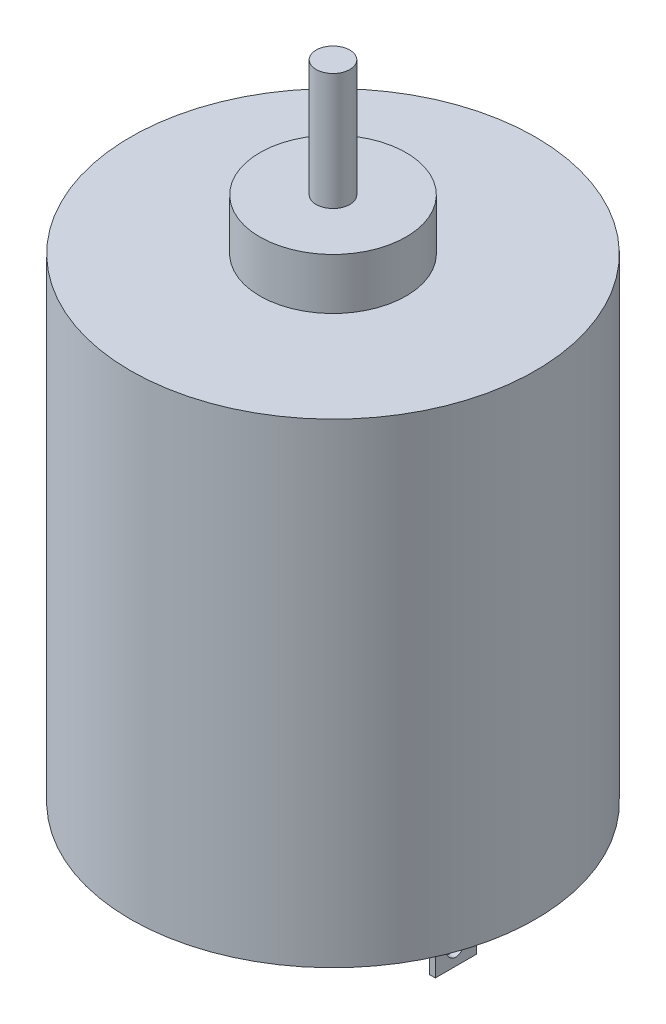
ISO-10303-21;
HEADER;
FILE_DESCRIPTION(('STEP AP214'),'2;1');
FILE_NAME('part.step','',(''),(''),'','','');
FILE_SCHEMA(('AUTOMOTIVE_DESIGN { 1 0 10303 214 1 1 1 1 }'));
ENDSEC;
DATA;
#1=APPLICATION_CONTEXT('core data for automotive mechanical design processes');
#2=APPLICATION_PROTOCOL_DEFINITION('international standard','automotive_design',2000,#1);
#3=PRODUCT_CONTEXT('',#1,'mechanical');
#4=PRODUCT('Part','Part','',(#3));
#5=PRODUCT_RELATED_PRODUCT_CATEGORY('part','',(#4));
#6=PRODUCT_DEFINITION_FORMATION('','',#4);
#7=PRODUCT_DEFINITION_CONTEXT('part definition',#1,'design');
#8=PRODUCT_DEFINITION('design','',#6,#7);
#9=PRODUCT_DEFINITION_SHAPE('','',#8);
#10=(LENGTH_UNIT() NAMED_UNIT(*) SI_UNIT(.MILLI.,.METRE.));
#11=(NAMED_UNIT(*) PLANE_ANGLE_UNIT() SI_UNIT($,.RADIAN.));
#12=(NAMED_UNIT(*) SI_UNIT($,.STERADIAN.) SOLID_ANGLE_UNIT());
#13=UNCERTAINTY_MEASURE_WITH_UNIT(LENGTH_MEASURE(1.E-05),#10,'distance_accuracy_value','');
#14=(GEOMETRIC_REPRESENTATION_CONTEXT(3) GLOBAL_UNCERTAINTY_ASSIGNED_CONTEXT((#13)) GLOBAL_UNIT_ASSIGNED_CONTEXT((#10,
#11,#12)) REPRESENTATION_CONTEXT('',''));
#15=CARTESIAN_POINT('',(0.,0.,0.));
#16=DIRECTION('',(0.,0.,1.));
#17=DIRECTION('',(1.,0.,0.));
#18=AXIS2_PLACEMENT_3D('',#15,#16,#17);
#19=CARTESIAN_POINT('',(0.,0.,0.));
#20=DIRECTION('',(0.,1.,0.));
#21=DIRECTION('',(0.,0.,1.));
#22=AXIS2_PLACEMENT_3D('',#19,#20,#21);
#23=PLANE('',#22);
#24=DIRECTION('',(1.,0.,0.));
#25=VECTOR('',#24,1.);
#26=CARTESIAN_POINT('',(8.,0.,-1.4));
#27=LINE('',#26,#25);
#28=CARTESIAN_POINT('',(8.,0.,-1.4));
#29=VERTEX_POINT('',#28);
#30=CARTESIAN_POINT('',(8.4,0.,-1.4));
#31=VERTEX_POINT('',#30);
#32=EDGE_CURVE('E121',#29,#31,#27,.T.);
#33=ORIENTED_EDGE('',*,*,#32,.F.);
#34=DIRECTION('',(0.,0.,1.));
#35=VECTOR('',#34,1.);
#36=CARTESIAN_POINT('',(8.,0.,-1.4));
#37=LINE('',#36,#35);
#38=CARTESIAN_POINT('',(8.,0.,1.4));
#39=VERTEX_POINT('',#38);
#40=EDGE_CURVE('E140',#29,#39,#37,.T.);
#41=ORIENTED_EDGE('',*,*,#40,.T.);
#42=DIRECTION('',(1.,0.,0.));
#43=VECTOR('',#42,1.);
#44=CARTESIAN_POINT('',(8.,0.,1.4));
#45=LINE('',#44,#43);
#46=CARTESIAN_POINT('',(8.4,0.,1.4));
#47=VERTEX_POINT('',#46);
#48=EDGE_CURVE('E57',#39,#47,#45,.T.);
#49=ORIENTED_EDGE('',*,*,#48,.T.);
#50=DIRECTION('',(0.,0.,1.));
#51=VECTOR('',#50,1.);
#52=CARTESIAN_POINT('',(8.4,0.,-1.4));
#53=LINE('',#52,#51);
#54=EDGE_CURVE('E124',#31,#47,#53,.T.);
#55=ORIENTED_EDGE('',*,*,#54,.F.);
#56=EDGE_LOOP('',(#33,#41,#49,#55));
#57=FACE_BOUND('',#56,.T.);
#58=CARTESIAN_POINT('',(0.,0.,0.));
#59=DIRECTION('',(0.,1.,0.));
#60=DIRECTION('',(0.,0.,1.));
#61=AXIS2_PLACEMENT_3D('',#58,#59,#60);
#62=CIRCLE('',#61,5.);
#63=CARTESIAN_POINT('',(0.,0.,5.));
#64=VERTEX_POINT('',#63);
#65=EDGE_CURVE('E176',#64,#64,#62,.T.);
#66=ORIENTED_EDGE('',*,*,#65,.T.);
#67=EDGE_LOOP('',(#66));
#68=FACE_BOUND('',#67,.T.);
#69=CARTESIAN_POINT('',(0.,0.,0.));
#70=DIRECTION('',(0.,1.,0.));
#71=DIRECTION('',(0.,0.,1.));
#72=AXIS2_PLACEMENT_3D('',#69,#70,#71);
#73=CIRCLE('',#72,13.85);
#74=CARTESIAN_POINT('',(0.,0.,13.85));
#75=VERTEX_POINT('',#74);
#76=EDGE_CURVE('E182',#75,#75,#73,.T.);
#77=ORIENTED_EDGE('',*,*,#76,.F.);
#78=EDGE_LOOP('',(#77));
#79=FACE_BOUND('',#78,.T.);
#80=DIRECTION('',(1.,0.,0.));
#81=VECTOR('',#80,1.);
#82=CARTESIAN_POINT('',(-8.4,0.,-1.4));
#83=LINE('',#82,#81);
#84=CARTESIAN_POINT('',(-8.4,0.,-1.4));
#85=VERTEX_POINT('',#84);
#86=CARTESIAN_POINT('',(-8.,0.,-1.4));
#87=VERTEX_POINT('',#86);
#88=EDGE_CURVE('E104',#85,#87,#83,.T.);
#89=ORIENTED_EDGE('',*,*,#88,.F.);
#90=DIRECTION('',(0.,0.,1.));
#91=VECTOR('',#90,1.);
#92=CARTESIAN_POINT('',(-8.4,0.,-1.4));
#93=LINE('',#92,#91);
#94=CARTESIAN_POINT('',(-8.4,0.,1.4));
#95=VERTEX_POINT('',#94);
#96=EDGE_CURVE('E115',#85,#95,#93,.T.);
#97=ORIENTED_EDGE('',*,*,#96,.T.);
#98=DIRECTION('',(1.,0.,0.));
#99=VECTOR('',#98,1.);
#100=CARTESIAN_POINT('',(-8.4,0.,1.4));
#101=LINE('',#100,#99);
#102=CARTESIAN_POINT('',(-8.,0.,1.4));
#103=VERTEX_POINT('',#102);
#104=EDGE_CURVE('E49',#95,#103,#101,.T.);
#105=ORIENTED_EDGE('',*,*,#104,.T.);
#106=DIRECTION('',(0.,0.,1.));
#107=VECTOR('',#106,1.);
#108=CARTESIAN_POINT('',(-8.,0.,-1.4));
#109=LINE('',#108,#107);
#110=EDGE_CURVE('E120',#87,#103,#109,.T.);
#111=ORIENTED_EDGE('',*,*,#110,.F.);
#112=EDGE_LOOP('',(#89,#97,#105,#111));
#113=FACE_BOUND('',#112,.T.);
#114=ADVANCED_FACE('F34',(#57,#68,#79,#113),#23,.F.);
#115=CARTESIAN_POINT('',(0.,32.5,0.));
#116=DIRECTION('',(0.,-1.,0.));
#117=DIRECTION('',(0.,0.,-1.));
#118=AXIS2_PLACEMENT_3D('',#115,#116,#117);
#119=CYLINDRICAL_SURFACE('',#118,13.85);
#120=CARTESIAN_POINT('',(0.,32.5,0.));
#121=DIRECTION('',(0.,1.,0.));
#122=DIRECTION('',(0.,0.,1.));
#123=AXIS2_PLACEMENT_3D('',#120,#121,#122);
#124=CIRCLE('',#123,13.85);
#125=CARTESIAN_POINT('',(0.,32.5,13.85));
#126=VERTEX_POINT('',#125);
#127=EDGE_CURVE('E179',#126,#126,#124,.T.);
#128=ORIENTED_EDGE('',*,*,#127,.F.);
#129=EDGE_LOOP('',(#128));
#130=FACE_BOUND('',#129,.T.);
#131=ORIENTED_EDGE('',*,*,#76,.T.);
#132=EDGE_LOOP('',(#131));
#133=FACE_BOUND('',#132,.T.);
#134=ADVANCED_FACE('F36',(#130,#133),#119,.T.);
#135=CARTESIAN_POINT('',(0.,32.5,0.));
#136=DIRECTION('',(0.,1.,0.));
#137=DIRECTION('',(0.,0.,1.));
#138=AXIS2_PLACEMENT_3D('',#135,#136,#137);
#139=PLANE('',#138);
#140=CARTESIAN_POINT('',(0.,32.5,0.));
#141=DIRECTION('',(0.,1.,0.));
#142=DIRECTION('',(0.,0.,1.));
#143=AXIS2_PLACEMENT_3D('',#140,#141,#142);
#144=CIRCLE('',#143,5.);
#145=CARTESIAN_POINT('',(0.,32.5,5.));
#146=VERTEX_POINT('',#145);
#147=EDGE_CURVE('E42',#146,#146,#144,.T.);
#148=ORIENTED_EDGE('',*,*,#147,.F.);
#149=EDGE_LOOP('',(#148));
#150=FACE_BOUND('',#149,.T.);
#151=ORIENTED_EDGE('',*,*,#127,.T.);
#152=EDGE_LOOP('',(#151));
#153=FACE_BOUND('',#152,.T.);
#154=ADVANCED_FACE('F201',(#150,#153),#139,.T.);
#155=CARTESIAN_POINT('',(0.,-2.2,0.));
#156=DIRECTION('',(0.,1.,0.));
#157=DIRECTION('',(0.,0.,1.));
#158=AXIS2_PLACEMENT_3D('',#155,#156,#157);
#159=PLANE('',#158);
#160=CARTESIAN_POINT('',(0.,-2.2,0.));
#161=DIRECTION('',(0.,1.,0.));
#162=DIRECTION('',(0.,0.,1.));
#163=AXIS2_PLACEMENT_3D('',#160,#161,#162);
#164=CIRCLE('',#163,1.1525);
#165=CARTESIAN_POINT('',(0.,-2.2,1.1525));
#166=VERTEX_POINT('',#165);
#167=EDGE_CURVE('E167',#166,#166,#164,.T.);
#168=ORIENTED_EDGE('',*,*,#167,.T.);
#169=EDGE_LOOP('',(#168));
#170=FACE_BOUND('',#169,.T.);
#171=CARTESIAN_POINT('',(0.,-2.2,0.));
#172=DIRECTION('',(0.,1.,0.));
#173=DIRECTION('',(0.,0.,1.));
#174=AXIS2_PLACEMENT_3D('',#171,#172,#173);
#175=CIRCLE('',#174,5.);
#176=CARTESIAN_POINT('',(0.,-2.2,5.));
#177=VERTEX_POINT('',#176);
#178=EDGE_CURVE('E173',#177,#177,#175,.T.);
#179=ORIENTED_EDGE('',*,*,#178,.F.);
#180=EDGE_LOOP('',(#179));
#181=FACE_BOUND('',#180,.T.);
#182=ADVANCED_FACE('F192',(#170,#181),#159,.F.);
#183=CARTESIAN_POINT('',(0.,-2.2,0.));
#184=DIRECTION('',(0.,1.,0.));
#185=DIRECTION('',(0.,0.,1.));
#186=AXIS2_PLACEMENT_3D('',#183,#184,#185);
#187=CYLINDRICAL_SURFACE('',#186,5.);
#188=ORIENTED_EDGE('',*,*,#178,.T.);
#189=EDGE_LOOP('',(#188));
#190=FACE_BOUND('',#189,.T.);
#191=ORIENTED_EDGE('',*,*,#65,.F.);
#192=EDGE_LOOP('',(#191));
#193=FACE_BOUND('',#192,.T.);
#194=ADVANCED_FACE('F189',(#190,#193),#187,.T.);
#195=ORIENTED_EDGE('',*,*,#147,.T.);
#196=EDGE_LOOP('',(#195));
#197=FACE_BOUND('',#196,.T.);
#198=CARTESIAN_POINT('',(0.,36.,0.));
#199=DIRECTION('',(0.,1.,0.));
#200=DIRECTION('',(0.,0.,1.));
#201=AXIS2_PLACEMENT_3D('',#198,#199,#200);
#202=CIRCLE('',#201,5.);
#203=CARTESIAN_POINT('',(0.,36.,5.));
#204=VERTEX_POINT('',#203);
#205=EDGE_CURVE('E170',#204,#204,#202,.T.);
#206=ORIENTED_EDGE('',*,*,#205,.F.);
#207=EDGE_LOOP('',(#206));
#208=FACE_BOUND('',#207,.T.);
#209=ADVANCED_FACE('F191',(#197,#208),#187,.T.);
#210=CARTESIAN_POINT('',(0.,36.,0.));
#211=DIRECTION('',(0.,1.,0.));
#212=DIRECTION('',(0.,0.,1.));
#213=AXIS2_PLACEMENT_3D('',#210,#211,#212);
#214=PLANE('',#213);
#215=CARTESIAN_POINT('',(0.,36.,0.));
#216=DIRECTION('',(0.,1.,0.));
#217=DIRECTION('',(0.,0.,1.));
#218=AXIS2_PLACEMENT_3D('',#215,#216,#217);
#219=CIRCLE('',#218,1.1525);
#220=CARTESIAN_POINT('',(0.,36.,1.1525));
#221=VERTEX_POINT('',#220);
#222=EDGE_CURVE('E11',#221,#221,#219,.T.);
#223=ORIENTED_EDGE('',*,*,#222,.F.);
#224=EDGE_LOOP('',(#223));
#225=FACE_BOUND('',#224,.T.);
#226=ORIENTED_EDGE('',*,*,#205,.T.);
#227=EDGE_LOOP('',(#226));
#228=FACE_BOUND('',#227,.T.);
#229=ADVANCED_FACE('F199',(#225,#228),#214,.T.);
#230=CARTESIAN_POINT('',(0.,44.,0.));
#231=DIRECTION('',(0.,1.,0.));
#232=DIRECTION('',(0.,0.,1.));
#233=AXIS2_PLACEMENT_3D('',#230,#231,#232);
#234=PLANE('',#233);
#235=CARTESIAN_POINT('',(0.,44.,0.));
#236=DIRECTION('',(0.,1.,0.));
#237=DIRECTION('',(0.,0.,1.));
#238=AXIS2_PLACEMENT_3D('',#235,#236,#237);
#239=CIRCLE('',#238,1.1525);
#240=CARTESIAN_POINT('',(0.,44.,1.1525));
#241=VERTEX_POINT('',#240);
#242=EDGE_CURVE('E161',#241,#241,#239,.T.);
#243=ORIENTED_EDGE('',*,*,#242,.T.);
#244=EDGE_LOOP('',(#243));
#245=FACE_BOUND('',#244,.T.);
#246=ADVANCED_FACE('F225',(#245),#234,.T.);
#247=CARTESIAN_POINT('',(0.,-3.,0.));
#248=DIRECTION('',(0.,1.,0.));
#249=DIRECTION('',(0.,0.,1.));
#250=AXIS2_PLACEMENT_3D('',#247,#248,#249);
#251=CYLINDRICAL_SURFACE('',#250,1.1525);
#252=ORIENTED_EDGE('',*,*,#222,.T.);
#253=EDGE_LOOP('',(#252));
#254=FACE_BOUND('',#253,.T.);
#255=ORIENTED_EDGE('',*,*,#242,.F.);
#256=EDGE_LOOP('',(#255));
#257=FACE_BOUND('',#256,.T.);
#258=ADVANCED_FACE('F231',(#254,#257),#251,.T.);
#259=CARTESIAN_POINT('',(0.,-3.,0.));
#260=DIRECTION('',(0.,1.,0.));
#261=DIRECTION('',(0.,0.,1.));
#262=AXIS2_PLACEMENT_3D('',#259,#260,#261);
#263=CIRCLE('',#262,1.1525);
#264=CARTESIAN_POINT('',(0.,-3.,1.1525));
#265=VERTEX_POINT('',#264);
#266=EDGE_CURVE('E164',#265,#265,#263,.T.);
#267=ORIENTED_EDGE('',*,*,#266,.T.);
#268=EDGE_LOOP('',(#267));
#269=FACE_BOUND('',#268,.T.);
#270=ORIENTED_EDGE('',*,*,#167,.F.);
#271=EDGE_LOOP('',(#270));
#272=FACE_BOUND('',#271,.T.);
#273=ADVANCED_FACE('F238',(#269,#272),#251,.T.);
#274=CARTESIAN_POINT('',(0.,-3.,0.));
#275=DIRECTION('',(0.,1.,0.));
#276=DIRECTION('',(0.,0.,1.));
#277=AXIS2_PLACEMENT_3D('',#274,#275,#276);
#278=PLANE('',#277);
#279=ORIENTED_EDGE('',*,*,#266,.F.);
#280=EDGE_LOOP('',(#279));
#281=FACE_BOUND('',#280,.T.);
#282=ADVANCED_FACE('F240',(#281),#278,.F.);
#283=CARTESIAN_POINT('',(8.,-5.5,-1.4));
#284=DIRECTION('',(0.,0.,1.));
#285=DIRECTION('',(1.,0.,0.));
#286=AXIS2_PLACEMENT_3D('',#283,#284,#285);
#287=PLANE('',#286);
#288=ORIENTED_EDGE('',*,*,#32,.T.);
#289=DIRECTION('',(0.,1.,0.));
#290=VECTOR('',#289,1.);
#291=CARTESIAN_POINT('',(8.4,-5.5,-1.4));
#292=LINE('',#291,#290);
#293=CARTESIAN_POINT('',(8.4,-5.5,-1.4));
#294=VERTEX_POINT('',#293);
#295=EDGE_CURVE('E159',#294,#31,#292,.T.);
#296=ORIENTED_EDGE('',*,*,#295,.F.);
#297=DIRECTION('',(1.,0.,0.));
#298=VECTOR('',#297,1.);
#299=CARTESIAN_POINT('',(8.,-5.5,-1.4));
#300=LINE('',#299,#298);
#301=CARTESIAN_POINT('',(8.,-5.5,-1.4));
#302=VERTEX_POINT('',#301);
#303=EDGE_CURVE('E136',#302,#294,#300,.T.);
#304=ORIENTED_EDGE('',*,*,#303,.F.);
#305=DIRECTION('',(0.,1.,0.));
#306=VECTOR('',#305,1.);
#307=CARTESIAN_POINT('',(8.,-5.5,-1.4));
#308=LINE('',#307,#306);
#309=EDGE_CURVE('E147',#302,#29,#308,.T.);
#310=ORIENTED_EDGE('',*,*,#309,.T.);
#311=EDGE_LOOP('',(#288,#296,#304,#310));
#312=FACE_BOUND('',#311,.T.);
#313=ADVANCED_FACE('F242',(#312),#287,.F.);
#314=CARTESIAN_POINT('',(8.4,-5.5,-1.4));
#315=DIRECTION('',(-1.,0.,0.));
#316=DIRECTION('',(0.,0.,1.));
#317=AXIS2_PLACEMENT_3D('',#314,#315,#316);
#318=PLANE('',#317);
#319=CARTESIAN_POINT('',(8.4,-3.69757384433456,0.));
#320=DIRECTION('',(1.,0.,0.));
#321=DIRECTION('',(0.,-1.,0.));
#322=AXIS2_PLACEMENT_3D('',#319,#320,#321);
#323=ELLIPSE('',#322,1.26374785288164,0.80539975182603);
#324=CARTESIAN_POINT('',(8.4,-4.96132169721619,0.));
#325=VERTEX_POINT('',#324);
#326=EDGE_CURVE('E302',#325,#325,#323,.T.);
#327=ORIENTED_EDGE('',*,*,#326,.F.);
#328=EDGE_LOOP('',(#327));
#329=FACE_BOUND('',#328,.T.);
#330=ORIENTED_EDGE('',*,*,#54,.T.);
#331=DIRECTION('',(0.,1.,0.));
#332=VECTOR('',#331,1.);
#333=CARTESIAN_POINT('',(8.4,-5.5,1.4));
#334=LINE('',#333,#332);
#335=CARTESIAN_POINT('',(8.4,-5.5,1.4));
#336=VERTEX_POINT('',#335);
#337=EDGE_CURVE('E157',#336,#47,#334,.T.);
#338=ORIENTED_EDGE('',*,*,#337,.F.);
#339=DIRECTION('',(0.,0.,1.));
#340=VECTOR('',#339,1.);
#341=CARTESIAN_POINT('',(8.4,-5.5,-1.4));
#342=LINE('',#341,#340);
#343=EDGE_CURVE('E139',#294,#336,#342,.T.);
#344=ORIENTED_EDGE('',*,*,#343,.F.);
#345=ORIENTED_EDGE('',*,*,#295,.T.);
#346=EDGE_LOOP('',(#330,#338,#344,#345));
#347=FACE_BOUND('',#346,.T.);
#348=ADVANCED_FACE('F247',(#329,#347),#318,.F.);
#349=CARTESIAN_POINT('',(8.,-5.5,1.4));
#350=DIRECTION('',(0.,0.,1.));
#351=DIRECTION('',(1.,0.,0.));
#352=AXIS2_PLACEMENT_3D('',#349,#350,#351);
#353=PLANE('',#352);
#354=ORIENTED_EDGE('',*,*,#48,.F.);
#355=DIRECTION('',(0.,1.,0.));
#356=VECTOR('',#355,1.);
#357=CARTESIAN_POINT('',(8.,-5.5,1.4));
#358=LINE('',#357,#356);
#359=CARTESIAN_POINT('',(8.,-5.5,1.4));
#360=VERTEX_POINT('',#359);
#361=EDGE_CURVE('E155',#360,#39,#358,.T.);
#362=ORIENTED_EDGE('',*,*,#361,.F.);
#363=DIRECTION('',(1.,0.,0.));
#364=VECTOR('',#363,1.);
#365=CARTESIAN_POINT('',(8.,-5.5,1.4));
#366=LINE('',#365,#364);
#367=EDGE_CURVE('E142',#360,#336,#366,.T.);
#368=ORIENTED_EDGE('',*,*,#367,.T.);
#369=ORIENTED_EDGE('',*,*,#337,.T.);
#370=EDGE_LOOP('',(#354,#362,#368,#369));
#371=FACE_BOUND('',#370,.T.);
#372=ADVANCED_FACE('F251',(#371),#353,.T.);
#373=CARTESIAN_POINT('',(8.,-5.5,-1.4));
#374=DIRECTION('',(-1.,0.,0.));
#375=DIRECTION('',(0.,0.,1.));
#376=AXIS2_PLACEMENT_3D('',#373,#374,#375);
#377=PLANE('',#376);
#378=CARTESIAN_POINT('',(8.,-3.69757384433456,0.));
#379=DIRECTION('',(1.,0.,0.));
#380=DIRECTION('',(0.,-1.,0.));
#381=AXIS2_PLACEMENT_3D('',#378,#379,#380);
#382=ELLIPSE('',#381,1.26374785288164,0.80539975182603);
#383=CARTESIAN_POINT('',(8.,-4.96132169721619,0.));
#384=VERTEX_POINT('',#383);
#385=EDGE_CURVE('E306',#384,#384,#382,.T.);
#386=ORIENTED_EDGE('',*,*,#385,.T.);
#387=EDGE_LOOP('',(#386));
#388=FACE_BOUND('',#387,.T.);
#389=ORIENTED_EDGE('',*,*,#40,.F.);
#390=ORIENTED_EDGE('',*,*,#309,.F.);
#391=DIRECTION('',(0.,0.,1.));
#392=VECTOR('',#391,1.);
#393=CARTESIAN_POINT('',(8.,-5.5,-1.4));
#394=LINE('',#393,#392);
#395=EDGE_CURVE('E145',#302,#360,#394,.T.);
#396=ORIENTED_EDGE('',*,*,#395,.T.);
#397=ORIENTED_EDGE('',*,*,#361,.T.);
#398=EDGE_LOOP('',(#389,#390,#396,#397));
#399=FACE_BOUND('',#398,.T.);
#400=ADVANCED_FACE('F255',(#388,#399),#377,.T.);
#401=CARTESIAN_POINT('',(0.,-5.5,0.));
#402=DIRECTION('',(0.,-1.,0.));
#403=DIRECTION('',(0.,0.,-1.));
#404=AXIS2_PLACEMENT_3D('',#401,#402,#403);
#405=PLANE('',#404);
#406=ORIENTED_EDGE('',*,*,#303,.T.);
#407=ORIENTED_EDGE('',*,*,#343,.T.);
#408=ORIENTED_EDGE('',*,*,#367,.F.);
#409=ORIENTED_EDGE('',*,*,#395,.F.);
#410=EDGE_LOOP('',(#406,#407,#408,#409));
#411=FACE_BOUND('',#410,.T.);
#412=ADVANCED_FACE('F258',(#411),#405,.T.);
#413=CARTESIAN_POINT('',(-8.4,-5.5,-1.4));
#414=DIRECTION('',(0.,0.,1.));
#415=DIRECTION('',(1.,0.,0.));
#416=AXIS2_PLACEMENT_3D('',#413,#414,#415);
#417=PLANE('',#416);
#418=ORIENTED_EDGE('',*,*,#88,.T.);
#419=DIRECTION('',(0.,1.,0.));
#420=VECTOR('',#419,1.);
#421=CARTESIAN_POINT('',(-8.,-5.5,-1.4));
#422=LINE('',#421,#420);
#423=CARTESIAN_POINT('',(-8.,-5.5,-1.4));
#424=VERTEX_POINT('',#423);
#425=EDGE_CURVE('E291',#424,#87,#422,.T.);
#426=ORIENTED_EDGE('',*,*,#425,.F.);
#427=DIRECTION('',(1.,0.,0.));
#428=VECTOR('',#427,1.);
#429=CARTESIAN_POINT('',(-8.4,-5.5,-1.4));
#430=LINE('',#429,#428);
#431=CARTESIAN_POINT('',(-8.4,-5.5,-1.4));
#432=VERTEX_POINT('',#431);
#433=EDGE_CURVE('E107',#432,#424,#430,.T.);
#434=ORIENTED_EDGE('',*,*,#433,.F.);
#435=DIRECTION('',(0.,1.,0.));
#436=VECTOR('',#435,1.);
#437=CARTESIAN_POINT('',(-8.4,-5.5,-1.4));
#438=LINE('',#437,#436);
#439=EDGE_CURVE('E99',#432,#85,#438,.T.);
#440=ORIENTED_EDGE('',*,*,#439,.T.);
#441=EDGE_LOOP('',(#418,#426,#434,#440));
#442=FACE_BOUND('',#441,.T.);
#443=ADVANCED_FACE('F101',(#442),#417,.F.);
#444=CARTESIAN_POINT('',(-8.,-5.5,-1.4));
#445=DIRECTION('',(-1.,0.,0.));
#446=DIRECTION('',(0.,0.,1.));
#447=AXIS2_PLACEMENT_3D('',#444,#445,#446);
#448=PLANE('',#447);
#449=CARTESIAN_POINT('',(-8.,-3.69757384433456,0.));
#450=DIRECTION('',(-1.,0.,0.));
#451=DIRECTION('',(0.,1.,0.));
#452=AXIS2_PLACEMENT_3D('',#449,#450,#451);
#453=ELLIPSE('',#452,1.26374785288164,0.80539975182603);
#454=CARTESIAN_POINT('',(-8.,-2.43382599145292,0.));
#455=VERTEX_POINT('',#454);
#456=EDGE_CURVE('E299',#455,#455,#453,.F.);
#457=ORIENTED_EDGE('',*,*,#456,.F.);
#458=EDGE_LOOP('',(#457));
#459=FACE_BOUND('',#458,.T.);
#460=ORIENTED_EDGE('',*,*,#110,.T.);
#461=DIRECTION('',(0.,1.,0.));
#462=VECTOR('',#461,1.);
#463=CARTESIAN_POINT('',(-8.,-5.5,1.4));
#464=LINE('',#463,#462);
#465=CARTESIAN_POINT('',(-8.,-5.5,1.4));
#466=VERTEX_POINT('',#465);
#467=EDGE_CURVE('E293',#466,#103,#464,.T.);
#468=ORIENTED_EDGE('',*,*,#467,.F.);
#469=DIRECTION('',(0.,0.,1.));
#470=VECTOR('',#469,1.);
#471=CARTESIAN_POINT('',(-8.,-5.5,-1.4));
#472=LINE('',#471,#470);
#473=EDGE_CURVE('E133',#424,#466,#472,.T.);
#474=ORIENTED_EDGE('',*,*,#473,.F.);
#475=ORIENTED_EDGE('',*,*,#425,.T.);
#476=EDGE_LOOP('',(#460,#468,#474,#475));
#477=FACE_BOUND('',#476,.T.);
#478=ADVANCED_FACE('F274',(#459,#477),#448,.F.);
#479=CARTESIAN_POINT('',(-8.4,-5.5,1.4));
#480=DIRECTION('',(0.,0.,1.));
#481=DIRECTION('',(1.,0.,0.));
#482=AXIS2_PLACEMENT_3D('',#479,#480,#481);
#483=PLANE('',#482);
#484=ORIENTED_EDGE('',*,*,#104,.F.);
#485=DIRECTION('',(0.,1.,0.));
#486=VECTOR('',#485,1.);
#487=CARTESIAN_POINT('',(-8.4,-5.5,1.4));
#488=LINE('',#487,#486);
#489=CARTESIAN_POINT('',(-8.4,-5.5,1.4));
#490=VERTEX_POINT('',#489);
#491=EDGE_CURVE('E112',#490,#95,#488,.T.);
#492=ORIENTED_EDGE('',*,*,#491,.F.);
#493=DIRECTION('',(1.,0.,0.));
#494=VECTOR('',#493,1.);
#495=CARTESIAN_POINT('',(-8.4,-5.5,1.4));
#496=LINE('',#495,#494);
#497=EDGE_CURVE('E130',#490,#466,#496,.T.);
#498=ORIENTED_EDGE('',*,*,#497,.T.);
#499=ORIENTED_EDGE('',*,*,#467,.T.);
#500=EDGE_LOOP('',(#484,#492,#498,#499));
#501=FACE_BOUND('',#500,.T.);
#502=ADVANCED_FACE('F270',(#501),#483,.T.);
#503=CARTESIAN_POINT('',(-8.4,-5.5,-1.4));
#504=DIRECTION('',(-1.,0.,0.));
#505=DIRECTION('',(0.,0.,1.));
#506=AXIS2_PLACEMENT_3D('',#503,#504,#505);
#507=PLANE('',#506);
#508=CARTESIAN_POINT('',(-8.4,-3.69757384433456,0.));
#509=DIRECTION('',(-1.,0.,0.));
#510=DIRECTION('',(0.,1.,0.));
#511=AXIS2_PLACEMENT_3D('',#508,#509,#510);
#512=ELLIPSE('',#511,1.26374785288164,0.80539975182603);
#513=CARTESIAN_POINT('',(-8.4,-2.43382599145292,0.));
#514=VERTEX_POINT('',#513);
#515=EDGE_CURVE('E289',#514,#514,#512,.T.);
#516=ORIENTED_EDGE('',*,*,#515,.F.);
#517=EDGE_LOOP('',(#516));
#518=FACE_BOUND('',#517,.T.);
#519=ORIENTED_EDGE('',*,*,#96,.F.);
#520=ORIENTED_EDGE('',*,*,#439,.F.);
#521=DIRECTION('',(0.,0.,1.));
#522=VECTOR('',#521,1.);
#523=CARTESIAN_POINT('',(-8.4,-5.5,-1.4));
#524=LINE('',#523,#522);
#525=EDGE_CURVE('E111',#432,#490,#524,.T.);
#526=ORIENTED_EDGE('',*,*,#525,.T.);
#527=ORIENTED_EDGE('',*,*,#491,.T.);
#528=EDGE_LOOP('',(#519,#520,#526,#527));
#529=FACE_BOUND('',#528,.T.);
#530=ADVANCED_FACE('F116',(#518,#529),#507,.T.);
#531=CARTESIAN_POINT('',(0.,-5.5,0.));
#532=DIRECTION('',(0.,-1.,0.));
#533=DIRECTION('',(0.,0.,-1.));
#534=AXIS2_PLACEMENT_3D('',#531,#532,#533);
#535=PLANE('',#534);
#536=ORIENTED_EDGE('',*,*,#433,.T.);
#537=ORIENTED_EDGE('',*,*,#473,.T.);
#538=ORIENTED_EDGE('',*,*,#497,.F.);
#539=ORIENTED_EDGE('',*,*,#525,.F.);
#540=EDGE_LOOP('',(#536,#537,#538,#539));
#541=FACE_BOUND('',#540,.T.);
#542=ADVANCED_FACE('F263',(#541),#535,.T.);
#543=CARTESIAN_POINT('',(13.851,-3.69757384433456,0.));
#544=DIRECTION('',(-1.,0.,0.));
#545=DIRECTION('',(0.,1.,0.));
#546=AXIS2_PLACEMENT_3D('',#543,#544,#545);
#547=ELLIPSE('',#546,1.26374785288164,0.80539975182603);
#548=DIRECTION('',(-1.,0.,0.));
#549=VECTOR('',#548,1.);
#550=SURFACE_OF_LINEAR_EXTRUSION('',#547,#549);
#551=ORIENTED_EDGE('',*,*,#515,.T.);
#552=EDGE_LOOP('',(#551));
#553=FACE_BOUND('',#552,.T.);
#554=ORIENTED_EDGE('',*,*,#456,.T.);
#555=EDGE_LOOP('',(#554));
#556=FACE_BOUND('',#555,.T.);
#557=ADVANCED_FACE('F266',(#553,#556),#550,.F.);
#558=CARTESIAN_POINT('',(-13.851,-3.69757384433456,0.));
#559=DIRECTION('',(1.,0.,0.));
#560=DIRECTION('',(0.,-1.,0.));
#561=AXIS2_PLACEMENT_3D('',#558,#559,#560);
#562=ELLIPSE('',#561,1.26374785288164,0.80539975182603);
#563=DIRECTION('',(1.,0.,0.));
#564=VECTOR('',#563,1.);
#565=SURFACE_OF_LINEAR_EXTRUSION('',#562,#564);
#566=ORIENTED_EDGE('',*,*,#385,.F.);
#567=EDGE_LOOP('',(#566));
#568=FACE_BOUND('',#567,.T.);
#569=ORIENTED_EDGE('',*,*,#326,.T.);
#570=EDGE_LOOP('',(#569));
#571=FACE_BOUND('',#570,.T.);
#572=ADVANCED_FACE('F283',(#568,#571),#565,.F.);
#573=CLOSED_SHELL('',(#114,#134,#154,#182,#194,#209,#229,#246,#258,#273,#282,#313,#348,#372,
#400,#412,#443,#478,#502,#530,#542,#557,#572));
#574=MANIFOLD_SOLID_BREP('B2',#573);
#575=ADVANCED_BREP_SHAPE_REPRESENTATION('',(#18,#574),#14);
#576=SHAPE_DEFINITION_REPRESENTATION(#9,#575);
ENDSEC;
END-ISO-10303-21;
